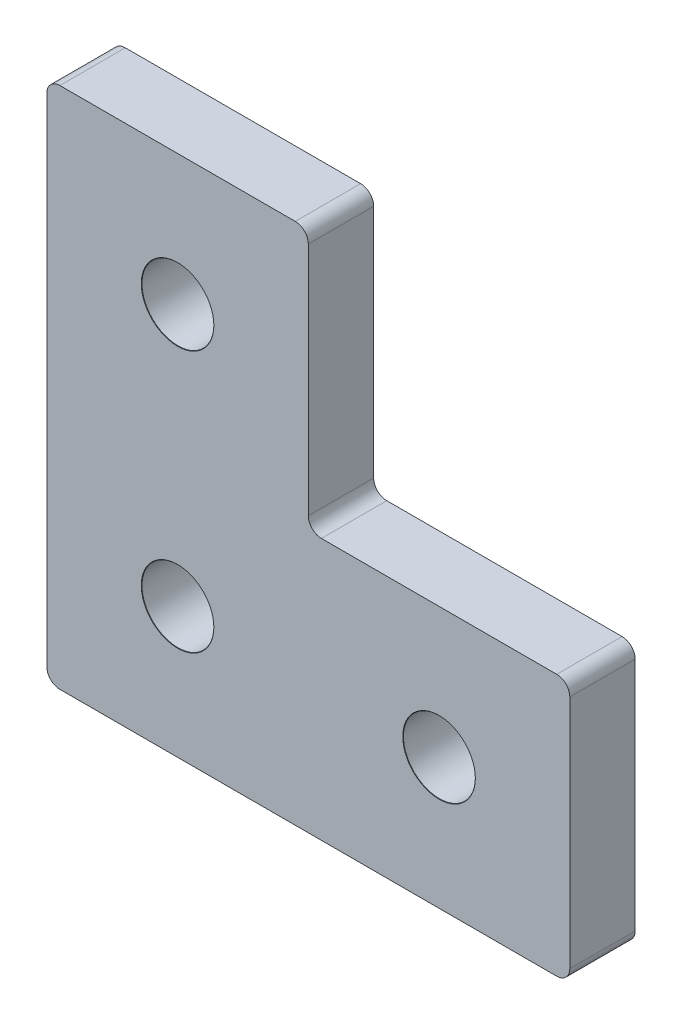
ISO-10303-21;
HEADER;
FILE_DESCRIPTION(('STEP AP214'),'2;1');
FILE_NAME('part.step','',(''),(''),'','','');
FILE_SCHEMA(('AUTOMOTIVE_DESIGN { 1 0 10303 214 1 1 1 1 }'));
ENDSEC;
DATA;
#1=APPLICATION_CONTEXT('core data for automotive mechanical design processes');
#2=APPLICATION_PROTOCOL_DEFINITION('international standard','automotive_design',2000,#1);
#3=PRODUCT_CONTEXT('',#1,'mechanical');
#4=PRODUCT('Part','Part','',(#3));
#5=PRODUCT_RELATED_PRODUCT_CATEGORY('part','',(#4));
#6=PRODUCT_DEFINITION_FORMATION('','',#4);
#7=PRODUCT_DEFINITION_CONTEXT('part definition',#1,'design');
#8=PRODUCT_DEFINITION('design','',#6,#7);
#9=PRODUCT_DEFINITION_SHAPE('','',#8);
#10=(LENGTH_UNIT() NAMED_UNIT(*) SI_UNIT(.MILLI.,.METRE.));
#11=(NAMED_UNIT(*) PLANE_ANGLE_UNIT() SI_UNIT($,.RADIAN.));
#12=(NAMED_UNIT(*) SI_UNIT($,.STERADIAN.) SOLID_ANGLE_UNIT());
#13=UNCERTAINTY_MEASURE_WITH_UNIT(LENGTH_MEASURE(1.E-05),#10,'distance_accuracy_value','');
#14=(GEOMETRIC_REPRESENTATION_CONTEXT(3) GLOBAL_UNCERTAINTY_ASSIGNED_CONTEXT((#13)) GLOBAL_UNIT_ASSIGNED_CONTEXT((#10,
#11,#12)) REPRESENTATION_CONTEXT('',''));
#15=CARTESIAN_POINT('',(0.,0.,0.));
#16=DIRECTION('',(0.,0.,1.));
#17=DIRECTION('',(1.,0.,0.));
#18=AXIS2_PLACEMENT_3D('',#15,#16,#17);
#19=CARTESIAN_POINT('',(1.,1.,5.));
#20=DIRECTION('',(0.,0.,-1.));
#21=DIRECTION('',(-1.,0.,0.));
#22=AXIS2_PLACEMENT_3D('',#19,#20,#21);
#23=CYLINDRICAL_SURFACE('',#22,1.);
#24=CARTESIAN_POINT('',(1.,1.,0.));
#25=DIRECTION('',(0.,0.,1.));
#26=DIRECTION('',(-1.,0.,0.));
#27=AXIS2_PLACEMENT_3D('',#24,#25,#26);
#28=CIRCLE('',#27,1.);
#29=CARTESIAN_POINT('',(0.,1.00000000000001,0.));
#30=VERTEX_POINT('',#29);
#31=CARTESIAN_POINT('',(1.00000000000001,0.,0.));
#32=VERTEX_POINT('',#31);
#33=EDGE_CURVE('E170',#30,#32,#28,.T.);
#34=ORIENTED_EDGE('',*,*,#33,.T.);
#35=DIRECTION('',(0.,0.,-1.));
#36=VECTOR('',#35,1.);
#37=CARTESIAN_POINT('',(1.00000000000001,0.,5.));
#38=LINE('',#37,#36);
#39=CARTESIAN_POINT('',(1.00000000000001,0.,5.));
#40=VERTEX_POINT('',#39);
#41=EDGE_CURVE('E11',#40,#32,#38,.T.);
#42=ORIENTED_EDGE('',*,*,#41,.F.);
#43=CARTESIAN_POINT('',(1.,1.,5.));
#44=DIRECTION('',(0.,0.,1.));
#45=DIRECTION('',(-1.,0.,0.));
#46=AXIS2_PLACEMENT_3D('',#43,#44,#45);
#47=CIRCLE('',#46,1.);
#48=CARTESIAN_POINT('',(0.,1.00000000000001,5.));
#49=VERTEX_POINT('',#48);
#50=EDGE_CURVE('E205',#49,#40,#47,.T.);
#51=ORIENTED_EDGE('',*,*,#50,.F.);
#52=DIRECTION('',(0.,0.,-1.));
#53=VECTOR('',#52,1.);
#54=CARTESIAN_POINT('',(0.,1.00000000000001,5.));
#55=LINE('',#54,#53);
#56=EDGE_CURVE('E166',#49,#30,#55,.T.);
#57=ORIENTED_EDGE('',*,*,#56,.T.);
#58=EDGE_LOOP('',(#34,#42,#51,#57));
#59=FACE_BOUND('',#58,.T.);
#60=ADVANCED_FACE('F45',(#59),#23,.T.);
#61=CARTESIAN_POINT('',(1.00000000000001,0.,5.));
#62=DIRECTION('',(0.,1.,0.));
#63=DIRECTION('',(0.,0.,1.));
#64=AXIS2_PLACEMENT_3D('',#61,#62,#63);
#65=PLANE('',#64);
#66=DIRECTION('',(1.,0.,0.));
#67=VECTOR('',#66,1.);
#68=CARTESIAN_POINT('',(1.00000000000001,0.,0.));
#69=LINE('',#68,#67);
#70=CARTESIAN_POINT('',(39.,0.,0.));
#71=VERTEX_POINT('',#70);
#72=EDGE_CURVE('E174',#32,#71,#69,.T.);
#73=ORIENTED_EDGE('',*,*,#72,.T.);
#74=DIRECTION('',(0.,0.,-1.));
#75=VECTOR('',#74,1.);
#76=CARTESIAN_POINT('',(39.,0.,5.));
#77=LINE('',#76,#75);
#78=CARTESIAN_POINT('',(39.,0.,5.));
#79=VERTEX_POINT('',#78);
#80=EDGE_CURVE('E54',#79,#71,#77,.T.);
#81=ORIENTED_EDGE('',*,*,#80,.F.);
#82=DIRECTION('',(1.,0.,0.));
#83=VECTOR('',#82,1.);
#84=CARTESIAN_POINT('',(1.00000000000001,0.,5.));
#85=LINE('',#84,#83);
#86=EDGE_CURVE('E117',#40,#79,#85,.T.);
#87=ORIENTED_EDGE('',*,*,#86,.F.);
#88=ORIENTED_EDGE('',*,*,#41,.T.);
#89=EDGE_LOOP('',(#73,#81,#87,#88));
#90=FACE_BOUND('',#89,.T.);
#91=ADVANCED_FACE('F300',(#90),#65,.F.);
#92=CARTESIAN_POINT('',(39.,1.,5.));
#93=DIRECTION('',(0.,0.,-1.));
#94=DIRECTION('',(-1.,0.,0.));
#95=AXIS2_PLACEMENT_3D('',#92,#93,#94);
#96=CYLINDRICAL_SURFACE('',#95,1.);
#97=CARTESIAN_POINT('',(39.,1.,0.));
#98=DIRECTION('',(0.,0.,1.));
#99=DIRECTION('',(1.,0.,0.));
#100=AXIS2_PLACEMENT_3D('',#97,#98,#99);
#101=CIRCLE('',#100,1.);
#102=CARTESIAN_POINT('',(40.,1.,0.));
#103=VERTEX_POINT('',#102);
#104=EDGE_CURVE('E178',#71,#103,#101,.T.);
#105=ORIENTED_EDGE('',*,*,#104,.T.);
#106=DIRECTION('',(0.,0.,-1.));
#107=VECTOR('',#106,1.);
#108=CARTESIAN_POINT('',(40.,1.,5.));
#109=LINE('',#108,#107);
#110=CARTESIAN_POINT('',(40.,1.,5.));
#111=VERTEX_POINT('',#110);
#112=EDGE_CURVE('E232',#111,#103,#109,.T.);
#113=ORIENTED_EDGE('',*,*,#112,.F.);
#114=CARTESIAN_POINT('',(39.,1.,5.));
#115=DIRECTION('',(0.,0.,1.));
#116=DIRECTION('',(1.,0.,0.));
#117=AXIS2_PLACEMENT_3D('',#114,#115,#116);
#118=CIRCLE('',#117,1.);
#119=EDGE_CURVE('E242',#79,#111,#118,.T.);
#120=ORIENTED_EDGE('',*,*,#119,.F.);
#121=ORIENTED_EDGE('',*,*,#80,.T.);
#122=EDGE_LOOP('',(#105,#113,#120,#121));
#123=FACE_BOUND('',#122,.T.);
#124=ADVANCED_FACE('F240',(#123),#96,.T.);
#125=CARTESIAN_POINT('',(40.,1.00000000000001,5.));
#126=DIRECTION('',(-1.,0.,0.));
#127=DIRECTION('',(0.,0.,1.));
#128=AXIS2_PLACEMENT_3D('',#125,#126,#127);
#129=PLANE('',#128);
#130=DIRECTION('',(0.,1.,0.));
#131=VECTOR('',#130,1.);
#132=CARTESIAN_POINT('',(40.,1.00000000000001,0.));
#133=LINE('',#132,#131);
#134=CARTESIAN_POINT('',(40.,19.,0.));
#135=VERTEX_POINT('',#134);
#136=EDGE_CURVE('E181',#103,#135,#133,.T.);
#137=ORIENTED_EDGE('',*,*,#136,.T.);
#138=DIRECTION('',(0.,0.,-1.));
#139=VECTOR('',#138,1.);
#140=CARTESIAN_POINT('',(40.,19.,5.));
#141=LINE('',#140,#139);
#142=CARTESIAN_POINT('',(40.,19.,5.));
#143=VERTEX_POINT('',#142);
#144=EDGE_CURVE('E228',#143,#135,#141,.T.);
#145=ORIENTED_EDGE('',*,*,#144,.F.);
#146=DIRECTION('',(0.,1.,0.));
#147=VECTOR('',#146,1.);
#148=CARTESIAN_POINT('',(40.,1.00000000000001,5.));
#149=LINE('',#148,#147);
#150=EDGE_CURVE('E261',#111,#143,#149,.T.);
#151=ORIENTED_EDGE('',*,*,#150,.F.);
#152=ORIENTED_EDGE('',*,*,#112,.T.);
#153=EDGE_LOOP('',(#137,#145,#151,#152));
#154=FACE_BOUND('',#153,.T.);
#155=ADVANCED_FACE('F251',(#154),#129,.F.);
#156=CARTESIAN_POINT('',(39.,19.,5.));
#157=DIRECTION('',(0.,0.,-1.));
#158=DIRECTION('',(-1.,0.,0.));
#159=AXIS2_PLACEMENT_3D('',#156,#157,#158);
#160=CYLINDRICAL_SURFACE('',#159,1.);
#161=CARTESIAN_POINT('',(39.,19.,0.));
#162=DIRECTION('',(0.,0.,1.));
#163=DIRECTION('',(1.,0.,0.));
#164=AXIS2_PLACEMENT_3D('',#161,#162,#163);
#165=CIRCLE('',#164,1.);
#166=CARTESIAN_POINT('',(39.,20.,0.));
#167=VERTEX_POINT('',#166);
#168=EDGE_CURVE('E184',#135,#167,#165,.T.);
#169=ORIENTED_EDGE('',*,*,#168,.T.);
#170=DIRECTION('',(0.,0.,-1.));
#171=VECTOR('',#170,1.);
#172=CARTESIAN_POINT('',(39.,20.,5.));
#173=LINE('',#172,#171);
#174=CARTESIAN_POINT('',(39.,20.,5.));
#175=VERTEX_POINT('',#174);
#176=EDGE_CURVE('E224',#175,#167,#173,.T.);
#177=ORIENTED_EDGE('',*,*,#176,.F.);
#178=CARTESIAN_POINT('',(39.,19.,5.));
#179=DIRECTION('',(0.,0.,1.));
#180=DIRECTION('',(1.,0.,0.));
#181=AXIS2_PLACEMENT_3D('',#178,#179,#180);
#182=CIRCLE('',#181,1.);
#183=EDGE_CURVE('E257',#143,#175,#182,.T.);
#184=ORIENTED_EDGE('',*,*,#183,.F.);
#185=ORIENTED_EDGE('',*,*,#144,.T.);
#186=EDGE_LOOP('',(#169,#177,#184,#185));
#187=FACE_BOUND('',#186,.T.);
#188=ADVANCED_FACE('F255',(#187),#160,.T.);
#189=CARTESIAN_POINT('',(21.,20.,5.));
#190=DIRECTION('',(0.,-1.,0.));
#191=DIRECTION('',(0.,0.,-1.));
#192=AXIS2_PLACEMENT_3D('',#189,#190,#191);
#193=PLANE('',#192);
#194=DIRECTION('',(-1.,0.,0.));
#195=VECTOR('',#194,1.);
#196=CARTESIAN_POINT('',(21.,20.,0.));
#197=LINE('',#196,#195);
#198=CARTESIAN_POINT('',(21.,20.,0.));
#199=VERTEX_POINT('',#198);
#200=EDGE_CURVE('E187',#167,#199,#197,.T.);
#201=ORIENTED_EDGE('',*,*,#200,.T.);
#202=DIRECTION('',(0.,0.,-1.));
#203=VECTOR('',#202,1.);
#204=CARTESIAN_POINT('',(21.,20.,5.));
#205=LINE('',#204,#203);
#206=CARTESIAN_POINT('',(21.,20.,5.));
#207=VERTEX_POINT('',#206);
#208=EDGE_CURVE('E220',#207,#199,#205,.T.);
#209=ORIENTED_EDGE('',*,*,#208,.F.);
#210=DIRECTION('',(-1.,0.,0.));
#211=VECTOR('',#210,1.);
#212=CARTESIAN_POINT('',(21.,20.,5.));
#213=LINE('',#212,#211);
#214=EDGE_CURVE('E260',#175,#207,#213,.T.);
#215=ORIENTED_EDGE('',*,*,#214,.F.);
#216=ORIENTED_EDGE('',*,*,#176,.T.);
#217=EDGE_LOOP('',(#201,#209,#215,#216));
#218=FACE_BOUND('',#217,.T.);
#219=ADVANCED_FACE('F313',(#218),#193,.F.);
#220=CARTESIAN_POINT('',(21.,21.,5.));
#221=DIRECTION('',(0.,0.,-1.));
#222=DIRECTION('',(-1.,0.,0.));
#223=AXIS2_PLACEMENT_3D('',#220,#221,#222);
#224=CYLINDRICAL_SURFACE('',#223,1.);
#225=CARTESIAN_POINT('',(21.,21.,0.));
#226=DIRECTION('',(0.,0.,-1.));
#227=DIRECTION('',(1.,0.,0.));
#228=AXIS2_PLACEMENT_3D('',#225,#226,#227);
#229=CIRCLE('',#228,1.);
#230=CARTESIAN_POINT('',(20.,21.,0.));
#231=VERTEX_POINT('',#230);
#232=EDGE_CURVE('E190',#199,#231,#229,.T.);
#233=ORIENTED_EDGE('',*,*,#232,.T.);
#234=DIRECTION('',(0.,0.,-1.));
#235=VECTOR('',#234,1.);
#236=CARTESIAN_POINT('',(20.,21.,5.));
#237=LINE('',#236,#235);
#238=CARTESIAN_POINT('',(20.,21.,5.));
#239=VERTEX_POINT('',#238);
#240=EDGE_CURVE('E216',#239,#231,#237,.T.);
#241=ORIENTED_EDGE('',*,*,#240,.F.);
#242=CARTESIAN_POINT('',(21.,21.,5.));
#243=DIRECTION('',(0.,0.,-1.));
#244=DIRECTION('',(1.,0.,0.));
#245=AXIS2_PLACEMENT_3D('',#242,#243,#244);
#246=CIRCLE('',#245,1.);
#247=EDGE_CURVE('E265',#207,#239,#246,.T.);
#248=ORIENTED_EDGE('',*,*,#247,.F.);
#249=ORIENTED_EDGE('',*,*,#208,.T.);
#250=EDGE_LOOP('',(#233,#241,#248,#249));
#251=FACE_BOUND('',#250,.T.);
#252=ADVANCED_FACE('F316',(#251),#224,.F.);
#253=CARTESIAN_POINT('',(20.,39.,5.));
#254=DIRECTION('',(-1.,0.,0.));
#255=DIRECTION('',(0.,-1.,0.));
#256=AXIS2_PLACEMENT_3D('',#253,#254,#255);
#257=PLANE('',#256);
#258=DIRECTION('',(0.,1.,0.));
#259=VECTOR('',#258,1.);
#260=CARTESIAN_POINT('',(20.,39.,0.));
#261=LINE('',#260,#259);
#262=CARTESIAN_POINT('',(20.,39.,0.));
#263=VERTEX_POINT('',#262);
#264=EDGE_CURVE('E193',#231,#263,#261,.T.);
#265=ORIENTED_EDGE('',*,*,#264,.T.);
#266=DIRECTION('',(0.,0.,-1.));
#267=VECTOR('',#266,1.);
#268=CARTESIAN_POINT('',(20.,39.,5.));
#269=LINE('',#268,#267);
#270=CARTESIAN_POINT('',(20.,39.,5.));
#271=VERTEX_POINT('',#270);
#272=EDGE_CURVE('E212',#271,#263,#269,.T.);
#273=ORIENTED_EDGE('',*,*,#272,.F.);
#274=DIRECTION('',(0.,1.,0.));
#275=VECTOR('',#274,1.);
#276=CARTESIAN_POINT('',(20.,39.,5.));
#277=LINE('',#276,#275);
#278=EDGE_CURVE('E272',#239,#271,#277,.T.);
#279=ORIENTED_EDGE('',*,*,#278,.F.);
#280=ORIENTED_EDGE('',*,*,#240,.T.);
#281=EDGE_LOOP('',(#265,#273,#279,#280));
#282=FACE_BOUND('',#281,.T.);
#283=ADVANCED_FACE('F280',(#282),#257,.F.);
#284=CARTESIAN_POINT('',(19.,39.,5.));
#285=DIRECTION('',(0.,0.,-1.));
#286=DIRECTION('',(-1.,0.,0.));
#287=AXIS2_PLACEMENT_3D('',#284,#285,#286);
#288=CYLINDRICAL_SURFACE('',#287,1.);
#289=CARTESIAN_POINT('',(19.,39.,0.));
#290=DIRECTION('',(0.,0.,1.));
#291=DIRECTION('',(-1.,0.,0.));
#292=AXIS2_PLACEMENT_3D('',#289,#290,#291);
#293=CIRCLE('',#292,1.);
#294=CARTESIAN_POINT('',(19.,40.,0.));
#295=VERTEX_POINT('',#294);
#296=EDGE_CURVE('E196',#263,#295,#293,.T.);
#297=ORIENTED_EDGE('',*,*,#296,.T.);
#298=DIRECTION('',(0.,0.,-1.));
#299=VECTOR('',#298,1.);
#300=CARTESIAN_POINT('',(19.,40.,5.));
#301=LINE('',#300,#299);
#302=CARTESIAN_POINT('',(19.,40.,5.));
#303=VERTEX_POINT('',#302);
#304=EDGE_CURVE('E159',#303,#295,#301,.T.);
#305=ORIENTED_EDGE('',*,*,#304,.F.);
#306=CARTESIAN_POINT('',(19.,39.,5.));
#307=DIRECTION('',(0.,0.,1.));
#308=DIRECTION('',(-1.,0.,0.));
#309=AXIS2_PLACEMENT_3D('',#306,#307,#308);
#310=CIRCLE('',#309,1.);
#311=EDGE_CURVE('E148',#271,#303,#310,.T.);
#312=ORIENTED_EDGE('',*,*,#311,.F.);
#313=ORIENTED_EDGE('',*,*,#272,.T.);
#314=EDGE_LOOP('',(#297,#305,#312,#313));
#315=FACE_BOUND('',#314,.T.);
#316=ADVANCED_FACE('F284',(#315),#288,.T.);
#317=CARTESIAN_POINT('',(1.00000000000001,40.,5.));
#318=DIRECTION('',(0.,-1.,0.));
#319=DIRECTION('',(0.,0.,-1.));
#320=AXIS2_PLACEMENT_3D('',#317,#318,#319);
#321=PLANE('',#320);
#322=DIRECTION('',(-1.,0.,0.));
#323=VECTOR('',#322,1.);
#324=CARTESIAN_POINT('',(1.00000000000001,40.,0.));
#325=LINE('',#324,#323);
#326=CARTESIAN_POINT('',(1.00000000000001,40.,0.));
#327=VERTEX_POINT('',#326);
#328=EDGE_CURVE('E157',#295,#327,#325,.T.);
#329=ORIENTED_EDGE('',*,*,#328,.T.);
#330=DIRECTION('',(0.,0.,-1.));
#331=VECTOR('',#330,1.);
#332=CARTESIAN_POINT('',(1.00000000000001,40.,5.));
#333=LINE('',#332,#331);
#334=CARTESIAN_POINT('',(1.00000000000001,40.,5.));
#335=VERTEX_POINT('',#334);
#336=EDGE_CURVE('E154',#335,#327,#333,.T.);
#337=ORIENTED_EDGE('',*,*,#336,.F.);
#338=DIRECTION('',(-1.,0.,0.));
#339=VECTOR('',#338,1.);
#340=CARTESIAN_POINT('',(1.00000000000001,40.,5.));
#341=LINE('',#340,#339);
#342=EDGE_CURVE('E142',#303,#335,#341,.T.);
#343=ORIENTED_EDGE('',*,*,#342,.F.);
#344=ORIENTED_EDGE('',*,*,#304,.T.);
#345=EDGE_LOOP('',(#329,#337,#343,#344));
#346=FACE_BOUND('',#345,.T.);
#347=ADVANCED_FACE('F155',(#346),#321,.F.);
#348=CARTESIAN_POINT('',(1.,39.,5.));
#349=DIRECTION('',(0.,0.,-1.));
#350=DIRECTION('',(-1.,0.,0.));
#351=AXIS2_PLACEMENT_3D('',#348,#349,#350);
#352=CYLINDRICAL_SURFACE('',#351,1.);
#353=CARTESIAN_POINT('',(1.,39.,0.));
#354=DIRECTION('',(0.,0.,1.));
#355=DIRECTION('',(-1.,0.,0.));
#356=AXIS2_PLACEMENT_3D('',#353,#354,#355);
#357=CIRCLE('',#356,1.);
#358=CARTESIAN_POINT('',(0.,39.,0.));
#359=VERTEX_POINT('',#358);
#360=EDGE_CURVE('E103',#327,#359,#357,.T.);
#361=ORIENTED_EDGE('',*,*,#360,.T.);
#362=DIRECTION('',(0.,0.,-1.));
#363=VECTOR('',#362,1.);
#364=CARTESIAN_POINT('',(0.,39.,5.));
#365=LINE('',#364,#363);
#366=CARTESIAN_POINT('',(0.,39.,5.));
#367=VERTEX_POINT('',#366);
#368=EDGE_CURVE('E160',#367,#359,#365,.T.);
#369=ORIENTED_EDGE('',*,*,#368,.F.);
#370=CARTESIAN_POINT('',(1.,39.,5.));
#371=DIRECTION('',(0.,0.,1.));
#372=DIRECTION('',(-1.,0.,0.));
#373=AXIS2_PLACEMENT_3D('',#370,#371,#372);
#374=CIRCLE('',#373,1.);
#375=EDGE_CURVE('E146',#335,#367,#374,.T.);
#376=ORIENTED_EDGE('',*,*,#375,.F.);
#377=ORIENTED_EDGE('',*,*,#336,.T.);
#378=EDGE_LOOP('',(#361,#369,#376,#377));
#379=FACE_BOUND('',#378,.T.);
#380=ADVANCED_FACE('F162',(#379),#352,.T.);
#381=CARTESIAN_POINT('',(0.,1.00000000000001,5.));
#382=DIRECTION('',(1.,0.,0.));
#383=DIRECTION('',(0.,0.,-1.));
#384=AXIS2_PLACEMENT_3D('',#381,#382,#383);
#385=PLANE('',#384);
#386=DIRECTION('',(0.,-1.,0.));
#387=VECTOR('',#386,1.);
#388=CARTESIAN_POINT('',(0.,1.00000000000001,0.));
#389=LINE('',#388,#387);
#390=EDGE_CURVE('E109',#359,#30,#389,.T.);
#391=ORIENTED_EDGE('',*,*,#390,.T.);
#392=ORIENTED_EDGE('',*,*,#56,.F.);
#393=DIRECTION('',(0.,-1.,0.));
#394=VECTOR('',#393,1.);
#395=CARTESIAN_POINT('',(0.,1.00000000000001,5.));
#396=LINE('',#395,#394);
#397=EDGE_CURVE('E62',#367,#49,#396,.T.);
#398=ORIENTED_EDGE('',*,*,#397,.F.);
#399=ORIENTED_EDGE('',*,*,#368,.T.);
#400=EDGE_LOOP('',(#391,#392,#398,#399));
#401=FACE_BOUND('',#400,.T.);
#402=ADVANCED_FACE('F288',(#401),#385,.F.);
#403=CARTESIAN_POINT('',(1.,1.,5.));
#404=DIRECTION('',(0.,0.,-1.));
#405=DIRECTION('',(-1.,0.,0.));
#406=AXIS2_PLACEMENT_3D('',#403,#404,#405);
#407=PLANE('',#406);
#408=CARTESIAN_POINT('',(10.,30.,5.));
#409=DIRECTION('',(0.,0.,1.));
#410=DIRECTION('',(1.,0.,0.));
#411=AXIS2_PLACEMENT_3D('',#408,#409,#410);
#412=CIRCLE('',#411,2.775);
#413=CARTESIAN_POINT('',(12.775,30.,5.));
#414=VERTEX_POINT('',#413);
#415=EDGE_CURVE('E512',#414,#414,#412,.T.);
#416=ORIENTED_EDGE('',*,*,#415,.F.);
#417=EDGE_LOOP('',(#416));
#418=FACE_BOUND('',#417,.T.);
#419=CARTESIAN_POINT('',(10.,9.99999999999999,5.));
#420=DIRECTION('',(0.,0.,1.));
#421=DIRECTION('',(1.,0.,0.));
#422=AXIS2_PLACEMENT_3D('',#419,#420,#421);
#423=CIRCLE('',#422,2.775);
#424=CARTESIAN_POINT('',(12.775,9.99999999999999,5.));
#425=VERTEX_POINT('',#424);
#426=EDGE_CURVE('E522',#425,#425,#423,.T.);
#427=ORIENTED_EDGE('',*,*,#426,.F.);
#428=EDGE_LOOP('',(#427));
#429=FACE_BOUND('',#428,.T.);
#430=CARTESIAN_POINT('',(30.,9.99999999999999,5.));
#431=DIRECTION('',(0.,0.,1.));
#432=DIRECTION('',(1.,0.,0.));
#433=AXIS2_PLACEMENT_3D('',#430,#431,#432);
#434=CIRCLE('',#433,2.775);
#435=CARTESIAN_POINT('',(32.775,9.99999999999999,5.));
#436=VERTEX_POINT('',#435);
#437=EDGE_CURVE('E534',#436,#436,#434,.T.);
#438=ORIENTED_EDGE('',*,*,#437,.F.);
#439=EDGE_LOOP('',(#438));
#440=FACE_BOUND('',#439,.T.);
#441=ORIENTED_EDGE('',*,*,#50,.T.);
#442=ORIENTED_EDGE('',*,*,#86,.T.);
#443=ORIENTED_EDGE('',*,*,#119,.T.);
#444=ORIENTED_EDGE('',*,*,#150,.T.);
#445=ORIENTED_EDGE('',*,*,#183,.T.);
#446=ORIENTED_EDGE('',*,*,#214,.T.);
#447=ORIENTED_EDGE('',*,*,#247,.T.);
#448=ORIENTED_EDGE('',*,*,#278,.T.);
#449=ORIENTED_EDGE('',*,*,#311,.T.);
#450=ORIENTED_EDGE('',*,*,#342,.T.);
#451=ORIENTED_EDGE('',*,*,#375,.T.);
#452=ORIENTED_EDGE('',*,*,#397,.T.);
#453=EDGE_LOOP('',(#441,#442,#443,#444,#445,#446,#447,#448,#449,#450,#451,#452));
#454=FACE_BOUND('',#453,.T.);
#455=ADVANCED_FACE('F144',(#418,#429,#440,#454),#407,.F.);
#456=CARTESIAN_POINT('',(1.,1.,0.));
#457=DIRECTION('',(0.,0.,-1.));
#458=DIRECTION('',(-1.,0.,0.));
#459=AXIS2_PLACEMENT_3D('',#456,#457,#458);
#460=PLANE('',#459);
#461=CARTESIAN_POINT('',(10.,30.,0.));
#462=DIRECTION('',(0.,0.,1.));
#463=DIRECTION('',(1.,0.,0.));
#464=AXIS2_PLACEMENT_3D('',#461,#462,#463);
#465=CIRCLE('',#464,2.75);
#466=CARTESIAN_POINT('',(12.75,30.,0.));
#467=VERTEX_POINT('',#466);
#468=EDGE_CURVE('E516',#467,#467,#465,.T.);
#469=ORIENTED_EDGE('',*,*,#468,.T.);
#470=EDGE_LOOP('',(#469));
#471=FACE_BOUND('',#470,.T.);
#472=CARTESIAN_POINT('',(10.,9.99999999999999,0.));
#473=DIRECTION('',(0.,0.,1.));
#474=DIRECTION('',(1.,0.,0.));
#475=AXIS2_PLACEMENT_3D('',#472,#473,#474);
#476=CIRCLE('',#475,2.75);
#477=CARTESIAN_POINT('',(12.75,9.99999999999999,0.));
#478=VERTEX_POINT('',#477);
#479=EDGE_CURVE('E530',#478,#478,#476,.T.);
#480=ORIENTED_EDGE('',*,*,#479,.T.);
#481=EDGE_LOOP('',(#480));
#482=FACE_BOUND('',#481,.T.);
#483=CARTESIAN_POINT('',(30.,9.99999999999999,0.));
#484=DIRECTION('',(0.,0.,1.));
#485=DIRECTION('',(1.,0.,0.));
#486=AXIS2_PLACEMENT_3D('',#483,#484,#485);
#487=CIRCLE('',#486,2.75);
#488=CARTESIAN_POINT('',(32.75,9.99999999999999,0.));
#489=VERTEX_POINT('',#488);
#490=EDGE_CURVE('E175',#489,#489,#487,.T.);
#491=ORIENTED_EDGE('',*,*,#490,.T.);
#492=EDGE_LOOP('',(#491));
#493=FACE_BOUND('',#492,.T.);
#494=ORIENTED_EDGE('',*,*,#33,.F.);
#495=ORIENTED_EDGE('',*,*,#390,.F.);
#496=ORIENTED_EDGE('',*,*,#360,.F.);
#497=ORIENTED_EDGE('',*,*,#328,.F.);
#498=ORIENTED_EDGE('',*,*,#296,.F.);
#499=ORIENTED_EDGE('',*,*,#264,.F.);
#500=ORIENTED_EDGE('',*,*,#232,.F.);
#501=ORIENTED_EDGE('',*,*,#200,.F.);
#502=ORIENTED_EDGE('',*,*,#168,.F.);
#503=ORIENTED_EDGE('',*,*,#136,.F.);
#504=ORIENTED_EDGE('',*,*,#104,.F.);
#505=ORIENTED_EDGE('',*,*,#72,.F.);
#506=EDGE_LOOP('',(#494,#495,#496,#497,#498,#499,#500,#501,#502,#503,#504,#505));
#507=FACE_BOUND('',#506,.T.);
#508=ADVANCED_FACE('F246',(#471,#482,#493,#507),#460,.T.);
#509=CARTESIAN_POINT('',(30.,9.99999999999999,5.));
#510=DIRECTION('',(0.,0.,1.));
#511=DIRECTION('',(1.,0.,0.));
#512=AXIS2_PLACEMENT_3D('',#509,#510,#511);
#513=CYLINDRICAL_SURFACE('',#512,2.75);
#514=ORIENTED_EDGE('',*,*,#490,.F.);
#515=EDGE_LOOP('',(#514));
#516=FACE_BOUND('',#515,.T.);
#517=CARTESIAN_POINT('',(30.,9.99999999999999,4.975));
#518=DIRECTION('',(0.,0.,1.));
#519=DIRECTION('',(1.,0.,0.));
#520=AXIS2_PLACEMENT_3D('',#517,#518,#519);
#521=CIRCLE('',#520,2.75);
#522=CARTESIAN_POINT('',(32.75,9.99999999999999,4.975));
#523=VERTEX_POINT('',#522);
#524=EDGE_CURVE('E538',#523,#523,#521,.T.);
#525=ORIENTED_EDGE('',*,*,#524,.T.);
#526=EDGE_LOOP('',(#525));
#527=FACE_BOUND('',#526,.T.);
#528=ADVANCED_FACE('F356',(#516,#527),#513,.F.);
#529=CARTESIAN_POINT('',(30.,9.99999999999999,5.));
#530=DIRECTION('',(0.,0.,1.));
#531=DIRECTION('',(1.,0.,0.));
#532=AXIS2_PLACEMENT_3D('',#529,#530,#531);
#533=CONICAL_SURFACE('',#532,2.775,0.785398163397414);
#534=ORIENTED_EDGE('',*,*,#524,.F.);
#535=EDGE_LOOP('',(#534));
#536=FACE_BOUND('',#535,.T.);
#537=ORIENTED_EDGE('',*,*,#437,.T.);
#538=EDGE_LOOP('',(#537));
#539=FACE_BOUND('',#538,.T.);
#540=ADVANCED_FACE('F366',(#536,#539),#533,.F.);
#541=CARTESIAN_POINT('',(10.,9.99999999999999,5.));
#542=DIRECTION('',(0.,0.,1.));
#543=DIRECTION('',(1.,0.,0.));
#544=AXIS2_PLACEMENT_3D('',#541,#542,#543);
#545=CYLINDRICAL_SURFACE('',#544,2.75);
#546=ORIENTED_EDGE('',*,*,#479,.F.);
#547=EDGE_LOOP('',(#546));
#548=FACE_BOUND('',#547,.T.);
#549=CARTESIAN_POINT('',(10.,9.99999999999999,4.975));
#550=DIRECTION('',(0.,0.,1.));
#551=DIRECTION('',(1.,0.,0.));
#552=AXIS2_PLACEMENT_3D('',#549,#550,#551);
#553=CIRCLE('',#552,2.75);
#554=CARTESIAN_POINT('',(12.75,9.99999999999999,4.975));
#555=VERTEX_POINT('',#554);
#556=EDGE_CURVE('E526',#555,#555,#553,.T.);
#557=ORIENTED_EDGE('',*,*,#556,.T.);
#558=EDGE_LOOP('',(#557));
#559=FACE_BOUND('',#558,.T.);
#560=ADVANCED_FACE('F377',(#548,#559),#545,.F.);
#561=CARTESIAN_POINT('',(10.,9.99999999999999,5.));
#562=DIRECTION('',(0.,0.,1.));
#563=DIRECTION('',(1.,0.,0.));
#564=AXIS2_PLACEMENT_3D('',#561,#562,#563);
#565=CONICAL_SURFACE('',#564,2.775,0.785398163397483);
#566=ORIENTED_EDGE('',*,*,#556,.F.);
#567=EDGE_LOOP('',(#566));
#568=FACE_BOUND('',#567,.T.);
#569=ORIENTED_EDGE('',*,*,#426,.T.);
#570=EDGE_LOOP('',(#569));
#571=FACE_BOUND('',#570,.T.);
#572=ADVANCED_FACE('F388',(#568,#571),#565,.F.);
#573=CARTESIAN_POINT('',(10.,30.,5.));
#574=DIRECTION('',(0.,0.,1.));
#575=DIRECTION('',(1.,0.,0.));
#576=AXIS2_PLACEMENT_3D('',#573,#574,#575);
#577=CYLINDRICAL_SURFACE('',#576,2.75);
#578=ORIENTED_EDGE('',*,*,#468,.F.);
#579=EDGE_LOOP('',(#578));
#580=FACE_BOUND('',#579,.T.);
#581=CARTESIAN_POINT('',(10.,30.,4.975));
#582=DIRECTION('',(0.,0.,1.));
#583=DIRECTION('',(1.,0.,0.));
#584=AXIS2_PLACEMENT_3D('',#581,#582,#583);
#585=CIRCLE('',#584,2.75);
#586=CARTESIAN_POINT('',(12.75,30.,4.975));
#587=VERTEX_POINT('',#586);
#588=EDGE_CURVE('E509',#587,#587,#585,.T.);
#589=ORIENTED_EDGE('',*,*,#588,.T.);
#590=EDGE_LOOP('',(#589));
#591=FACE_BOUND('',#590,.T.);
#592=ADVANCED_FACE('F399',(#580,#591),#577,.F.);
#593=CARTESIAN_POINT('',(10.,30.,5.));
#594=DIRECTION('',(0.,0.,1.));
#595=DIRECTION('',(1.,0.,0.));
#596=AXIS2_PLACEMENT_3D('',#593,#594,#595);
#597=CONICAL_SURFACE('',#596,2.775,0.785398163397483);
#598=ORIENTED_EDGE('',*,*,#588,.F.);
#599=EDGE_LOOP('',(#598));
#600=FACE_BOUND('',#599,.T.);
#601=ORIENTED_EDGE('',*,*,#415,.T.);
#602=EDGE_LOOP('',(#601));
#603=FACE_BOUND('',#602,.T.);
#604=ADVANCED_FACE('F410',(#600,#603),#597,.F.);
#605=CLOSED_SHELL('',(#60,#91,#124,#155,#188,#219,#252,#283,#316,#347,#380,#402,#455,#508,#528,
#540,#560,#572,#592,#604));
#606=MANIFOLD_SOLID_BREP('B2',#605);
#607=ADVANCED_BREP_SHAPE_REPRESENTATION('',(#18,#606),#14);
#608=SHAPE_DEFINITION_REPRESENTATION(#9,#607);
ENDSEC;
END-ISO-10303-21;
